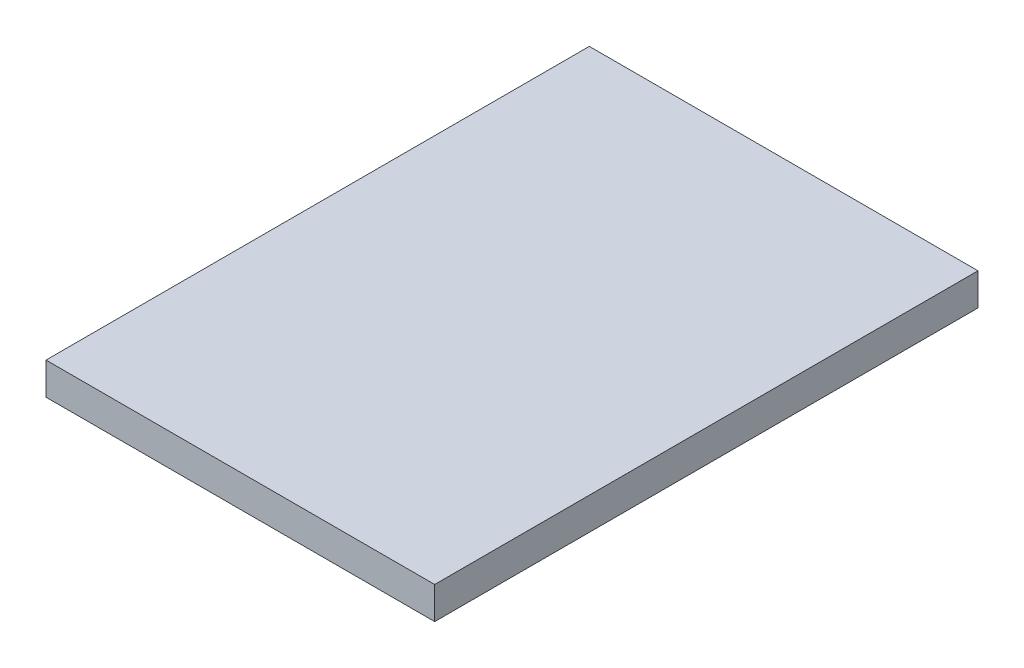
ISO-10303-21;
HEADER;
FILE_DESCRIPTION(('STEP AP214'),'2;1');
FILE_NAME('part.step','',(''),(''),'','','');
FILE_SCHEMA(('AUTOMOTIVE_DESIGN { 1 0 10303 214 1 1 1 1 }'));
ENDSEC;
DATA;
#1=APPLICATION_CONTEXT('core data for automotive mechanical design processes');
#2=APPLICATION_PROTOCOL_DEFINITION('international standard','automotive_design',2000,#1);
#3=PRODUCT_CONTEXT('',#1,'mechanical');
#4=PRODUCT('Part','Part','',(#3));
#5=PRODUCT_RELATED_PRODUCT_CATEGORY('part','',(#4));
#6=PRODUCT_DEFINITION_FORMATION('','',#4);
#7=PRODUCT_DEFINITION_CONTEXT('part definition',#1,'design');
#8=PRODUCT_DEFINITION('design','',#6,#7);
#9=PRODUCT_DEFINITION_SHAPE('','',#8);
#10=(LENGTH_UNIT() NAMED_UNIT(*) SI_UNIT(.MILLI.,.METRE.));
#11=(NAMED_UNIT(*) PLANE_ANGLE_UNIT() SI_UNIT($,.RADIAN.));
#12=(NAMED_UNIT(*) SI_UNIT($,.STERADIAN.) SOLID_ANGLE_UNIT());
#13=UNCERTAINTY_MEASURE_WITH_UNIT(LENGTH_MEASURE(1.E-05),#10,'distance_accuracy_value','');
#14=(GEOMETRIC_REPRESENTATION_CONTEXT(3) GLOBAL_UNCERTAINTY_ASSIGNED_CONTEXT((#13)) GLOBAL_UNIT_ASSIGNED_CONTEXT((#10,
#11,#12)) REPRESENTATION_CONTEXT('',''));
#15=CARTESIAN_POINT('',(0.,0.,0.));
#16=DIRECTION('',(0.,0.,1.));
#17=DIRECTION('',(1.,0.,0.));
#18=AXIS2_PLACEMENT_3D('',#15,#16,#17);
#19=CARTESIAN_POINT('',(9.3,1.54,13.));
#20=DIRECTION('',(-1.,0.,0.));
#21=DIRECTION('',(0.,0.,1.));
#22=AXIS2_PLACEMENT_3D('',#19,#20,#21);
#23=PLANE('',#22);
#24=DIRECTION('',(0.,0.,-1.));
#25=VECTOR('',#24,1.);
#26=CARTESIAN_POINT('',(9.3,0.,13.));
#27=LINE('',#26,#25);
#28=CARTESIAN_POINT('',(9.3,0.,13.));
#29=VERTEX_POINT('',#28);
#30=CARTESIAN_POINT('',(9.3,0.,-13.));
#31=VERTEX_POINT('',#30);
#32=EDGE_CURVE('E99',#29,#31,#27,.T.);
#33=ORIENTED_EDGE('',*,*,#32,.T.);
#34=DIRECTION('',(0.,-1.,0.));
#35=VECTOR('',#34,1.);
#36=CARTESIAN_POINT('',(9.3,1.54,-13.));
#37=LINE('',#36,#35);
#38=CARTESIAN_POINT('',(9.3,1.54,-13.));
#39=VERTEX_POINT('',#38);
#40=EDGE_CURVE('E11',#39,#31,#37,.T.);
#41=ORIENTED_EDGE('',*,*,#40,.F.);
#42=DIRECTION('',(0.,0.,-1.));
#43=VECTOR('',#42,1.);
#44=CARTESIAN_POINT('',(9.3,1.54,13.));
#45=LINE('',#44,#43);
#46=CARTESIAN_POINT('',(9.3,1.54,13.));
#47=VERTEX_POINT('',#46);
#48=EDGE_CURVE('E87',#47,#39,#45,.T.);
#49=ORIENTED_EDGE('',*,*,#48,.F.);
#50=DIRECTION('',(0.,-1.,0.));
#51=VECTOR('',#50,1.);
#52=CARTESIAN_POINT('',(9.3,1.54,13.));
#53=LINE('',#52,#51);
#54=EDGE_CURVE('E95',#47,#29,#53,.T.);
#55=ORIENTED_EDGE('',*,*,#54,.T.);
#56=EDGE_LOOP('',(#33,#41,#49,#55));
#57=FACE_BOUND('',#56,.T.);
#58=ADVANCED_FACE('F36',(#57),#23,.F.);
#59=CARTESIAN_POINT('',(-9.3,1.54,-13.));
#60=DIRECTION('',(0.,0.,1.));
#61=DIRECTION('',(1.,0.,0.));
#62=AXIS2_PLACEMENT_3D('',#59,#60,#61);
#63=PLANE('',#62);
#64=DIRECTION('',(-1.,0.,0.));
#65=VECTOR('',#64,1.);
#66=CARTESIAN_POINT('',(-9.3,0.,-13.));
#67=LINE('',#66,#65);
#68=CARTESIAN_POINT('',(-9.3,0.,-13.));
#69=VERTEX_POINT('',#68);
#70=EDGE_CURVE('E91',#31,#69,#67,.T.);
#71=ORIENTED_EDGE('',*,*,#70,.T.);
#72=DIRECTION('',(0.,-1.,0.));
#73=VECTOR('',#72,1.);
#74=CARTESIAN_POINT('',(-9.3,1.54,-13.));
#75=LINE('',#74,#73);
#76=CARTESIAN_POINT('',(-9.3,1.54,-13.));
#77=VERTEX_POINT('',#76);
#78=EDGE_CURVE('E44',#77,#69,#75,.T.);
#79=ORIENTED_EDGE('',*,*,#78,.F.);
#80=DIRECTION('',(-1.,0.,0.));
#81=VECTOR('',#80,1.);
#82=CARTESIAN_POINT('',(-9.3,1.54,-13.));
#83=LINE('',#82,#81);
#84=EDGE_CURVE('E82',#39,#77,#83,.T.);
#85=ORIENTED_EDGE('',*,*,#84,.F.);
#86=ORIENTED_EDGE('',*,*,#40,.T.);
#87=EDGE_LOOP('',(#71,#79,#85,#86));
#88=FACE_BOUND('',#87,.T.);
#89=ADVANCED_FACE('F90',(#88),#63,.F.);
#90=CARTESIAN_POINT('',(-9.3,1.54,13.));
#91=DIRECTION('',(1.,0.,0.));
#92=DIRECTION('',(0.,0.,-1.));
#93=AXIS2_PLACEMENT_3D('',#90,#91,#92);
#94=PLANE('',#93);
#95=DIRECTION('',(0.,0.,1.));
#96=VECTOR('',#95,1.);
#97=CARTESIAN_POINT('',(-9.3,0.,13.));
#98=LINE('',#97,#96);
#99=CARTESIAN_POINT('',(-9.3,0.,13.));
#100=VERTEX_POINT('',#99);
#101=EDGE_CURVE('E69',#69,#100,#98,.T.);
#102=ORIENTED_EDGE('',*,*,#101,.T.);
#103=DIRECTION('',(0.,-1.,0.));
#104=VECTOR('',#103,1.);
#105=CARTESIAN_POINT('',(-9.3,1.54,13.));
#106=LINE('',#105,#104);
#107=CARTESIAN_POINT('',(-9.3,1.54,13.));
#108=VERTEX_POINT('',#107);
#109=EDGE_CURVE('E92',#108,#100,#106,.T.);
#110=ORIENTED_EDGE('',*,*,#109,.F.);
#111=DIRECTION('',(0.,0.,1.));
#112=VECTOR('',#111,1.);
#113=CARTESIAN_POINT('',(-9.3,1.54,13.));
#114=LINE('',#113,#112);
#115=EDGE_CURVE('E85',#77,#108,#114,.T.);
#116=ORIENTED_EDGE('',*,*,#115,.F.);
#117=ORIENTED_EDGE('',*,*,#78,.T.);
#118=EDGE_LOOP('',(#102,#110,#116,#117));
#119=FACE_BOUND('',#118,.T.);
#120=ADVANCED_FACE('F93',(#119),#94,.F.);
#121=CARTESIAN_POINT('',(-9.3,1.54,13.));
#122=DIRECTION('',(0.,0.,-1.));
#123=DIRECTION('',(-1.,0.,0.));
#124=AXIS2_PLACEMENT_3D('',#121,#122,#123);
#125=PLANE('',#124);
#126=DIRECTION('',(1.,0.,0.));
#127=VECTOR('',#126,1.);
#128=CARTESIAN_POINT('',(-9.3,0.,13.));
#129=LINE('',#128,#127);
#130=EDGE_CURVE('E75',#100,#29,#129,.T.);
#131=ORIENTED_EDGE('',*,*,#130,.T.);
#132=ORIENTED_EDGE('',*,*,#54,.F.);
#133=DIRECTION('',(1.,0.,0.));
#134=VECTOR('',#133,1.);
#135=CARTESIAN_POINT('',(-9.3,1.54,13.));
#136=LINE('',#135,#134);
#137=EDGE_CURVE('E52',#108,#47,#136,.T.);
#138=ORIENTED_EDGE('',*,*,#137,.F.);
#139=ORIENTED_EDGE('',*,*,#109,.T.);
#140=EDGE_LOOP('',(#131,#132,#138,#139));
#141=FACE_BOUND('',#140,.T.);
#142=ADVANCED_FACE('F106',(#141),#125,.F.);
#143=CARTESIAN_POINT('',(0.,1.54,0.));
#144=DIRECTION('',(0.,-1.,0.));
#145=DIRECTION('',(0.,0.,-1.));
#146=AXIS2_PLACEMENT_3D('',#143,#144,#145);
#147=PLANE('',#146);
#148=ORIENTED_EDGE('',*,*,#48,.T.);
#149=ORIENTED_EDGE('',*,*,#84,.T.);
#150=ORIENTED_EDGE('',*,*,#115,.T.);
#151=ORIENTED_EDGE('',*,*,#137,.T.);
#152=EDGE_LOOP('',(#148,#149,#150,#151));
#153=FACE_BOUND('',#152,.T.);
#154=ADVANCED_FACE('F83',(#153),#147,.F.);
#155=CARTESIAN_POINT('',(0.,0.,0.));
#156=DIRECTION('',(0.,-1.,0.));
#157=DIRECTION('',(0.,0.,-1.));
#158=AXIS2_PLACEMENT_3D('',#155,#156,#157);
#159=PLANE('',#158);
#160=ORIENTED_EDGE('',*,*,#32,.F.);
#161=ORIENTED_EDGE('',*,*,#130,.F.);
#162=ORIENTED_EDGE('',*,*,#101,.F.);
#163=ORIENTED_EDGE('',*,*,#70,.F.);
#164=EDGE_LOOP('',(#160,#161,#162,#163));
#165=FACE_BOUND('',#164,.T.);
#166=ADVANCED_FACE('F109',(#165),#159,.T.);
#167=CLOSED_SHELL('',(#58,#89,#120,#142,#154,#166));
#168=MANIFOLD_SOLID_BREP('B2',#167);
#169=ADVANCED_BREP_SHAPE_REPRESENTATION('',(#18,#168),#14);
#170=SHAPE_DEFINITION_REPRESENTATION(#9,#169);
ENDSEC;
END-ISO-10303-21;
